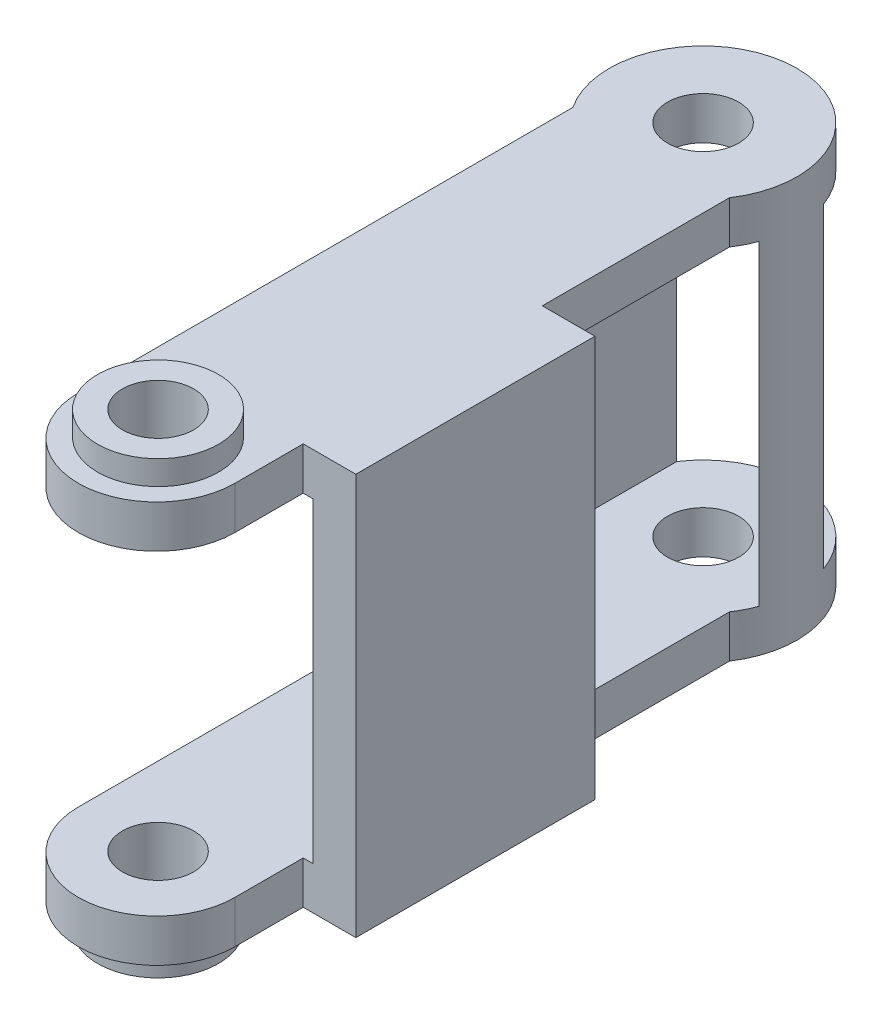
ISO-10303-21;
HEADER;
FILE_DESCRIPTION(('STEP AP214'),'2;1');
FILE_NAME('part.step','',(''),(''),'','','');
FILE_SCHEMA(('AUTOMOTIVE_DESIGN { 1 0 10303 214 1 1 1 1 }'));
ENDSEC;
DATA;
#1=APPLICATION_CONTEXT('core data for automotive mechanical design processes');
#2=APPLICATION_PROTOCOL_DEFINITION('international standard','automotive_design',2000,#1);
#3=PRODUCT_CONTEXT('',#1,'mechanical');
#4=PRODUCT('Part','Part','',(#3));
#5=PRODUCT_RELATED_PRODUCT_CATEGORY('part','',(#4));
#6=PRODUCT_DEFINITION_FORMATION('','',#4);
#7=PRODUCT_DEFINITION_CONTEXT('part definition',#1,'design');
#8=PRODUCT_DEFINITION('design','',#6,#7);
#9=PRODUCT_DEFINITION_SHAPE('','',#8);
#10=(LENGTH_UNIT() NAMED_UNIT(*) SI_UNIT(.MILLI.,.METRE.));
#11=(NAMED_UNIT(*) PLANE_ANGLE_UNIT() SI_UNIT($,.RADIAN.));
#12=(NAMED_UNIT(*) SI_UNIT($,.STERADIAN.) SOLID_ANGLE_UNIT());
#13=UNCERTAINTY_MEASURE_WITH_UNIT(LENGTH_MEASURE(1.E-05),#10,'distance_accuracy_value','');
#14=(GEOMETRIC_REPRESENTATION_CONTEXT(3) GLOBAL_UNCERTAINTY_ASSIGNED_CONTEXT((#13)) GLOBAL_UNIT_ASSIGNED_CONTEXT((#10,
#11,#12)) REPRESENTATION_CONTEXT('',''));
#15=CARTESIAN_POINT('',(0.,0.,0.));
#16=DIRECTION('',(0.,0.,1.));
#17=DIRECTION('',(1.,0.,0.));
#18=AXIS2_PLACEMENT_3D('',#15,#16,#17);
#19=CARTESIAN_POINT('',(-1.29999999999786,15.8000000000004,19.6500000000019));
#20=DIRECTION('',(0.,1.,0.));
#21=DIRECTION('',(0.,0.,1.));
#22=AXIS2_PLACEMENT_3D('',#19,#20,#21);
#23=PLANE('',#22);
#24=CARTESIAN_POINT('',(-1.29999999999786,15.8000000000004,19.6500000000019));
#25=DIRECTION('',(0.,1.,0.));
#26=DIRECTION('',(0.,0.,1.));
#27=AXIS2_PLACEMENT_3D('',#24,#25,#26);
#28=CIRCLE('',#27,2.5);
#29=CARTESIAN_POINT('',(-1.29999999999786,15.8000000000004,22.1500000000019));
#30=VERTEX_POINT('',#29);
#31=EDGE_CURVE('E19',#30,#30,#28,.F.);
#32=ORIENTED_EDGE('',*,*,#31,.T.);
#33=EDGE_LOOP('',(#32));
#34=FACE_BOUND('',#33,.T.);
#35=CARTESIAN_POINT('',(-1.29999999999786,15.8000000000004,19.6500000000019));
#36=DIRECTION('',(0.,1.,0.));
#37=DIRECTION('',(0.,0.,1.));
#38=AXIS2_PLACEMENT_3D('',#35,#36,#37);
#39=CIRCLE('',#38,4.25);
#40=CARTESIAN_POINT('',(-1.29999999999786,15.8000000000004,23.9000000000019));
#41=VERTEX_POINT('',#40);
#42=EDGE_CURVE('E115',#41,#41,#39,.F.);
#43=ORIENTED_EDGE('',*,*,#42,.F.);
#44=EDGE_LOOP('',(#43));
#45=FACE_BOUND('',#44,.T.);
#46=ADVANCED_FACE('F16',(#34,#45),#23,.T.);
#47=CARTESIAN_POINT('',(-1.29999999999791,-15.7999999999996,19.6500000000019));
#48=DIRECTION('',(0.,1.,0.));
#49=DIRECTION('',(0.,0.,1.));
#50=AXIS2_PLACEMENT_3D('',#47,#48,#49);
#51=CYLINDRICAL_SURFACE('',#50,2.5);
#52=CARTESIAN_POINT('',(-1.29999999999786,11.1000000000001,19.6500000000019));
#53=DIRECTION('',(0.,1.,0.));
#54=DIRECTION('',(0.,0.,1.));
#55=AXIS2_PLACEMENT_3D('',#52,#53,#54);
#56=CIRCLE('',#55,2.5);
#57=CARTESIAN_POINT('',(-1.29999999999786,11.1000000000001,22.1500000000019));
#58=VERTEX_POINT('',#57);
#59=EDGE_CURVE('E202',#58,#58,#56,.F.);
#60=ORIENTED_EDGE('',*,*,#59,.T.);
#61=EDGE_LOOP('',(#60));
#62=FACE_BOUND('',#61,.T.);
#63=ORIENTED_EDGE('',*,*,#31,.F.);
#64=EDGE_LOOP('',(#63));
#65=FACE_BOUND('',#64,.T.);
#66=ADVANCED_FACE('F214',(#62,#65),#51,.F.);
#67=CARTESIAN_POINT('',(-1.29999999999791,-14.0999999999996,19.7500000000022));
#68=DIRECTION('',(0.,1.,0.));
#69=DIRECTION('',(0.,0.,1.));
#70=AXIS2_PLACEMENT_3D('',#67,#68,#69);
#71=CYLINDRICAL_SURFACE('',#70,5.5);
#72=CARTESIAN_POINT('',(-1.29999999999775,14.1000000000004,19.7500000000022));
#73=DIRECTION('',(0.,1.,0.));
#74=DIRECTION('',(0.,0.,1.));
#75=AXIS2_PLACEMENT_3D('',#72,#73,#74);
#76=CIRCLE('',#75,5.5);
#77=CARTESIAN_POINT('',(-6.7999999999977,14.1000000000004,19.750000000002));
#78=VERTEX_POINT('',#77);
#79=CARTESIAN_POINT('',(4.20000000000242,14.1000000000004,19.750000000002));
#80=VERTEX_POINT('',#79);
#81=EDGE_CURVE('E196',#78,#80,#76,.T.);
#82=ORIENTED_EDGE('',*,*,#81,.F.);
#83=DIRECTION('',(0.,1.,0.));
#84=VECTOR('',#83,1.);
#85=CARTESIAN_POINT('',(-6.79999999999781,-14.0999999999996,19.7500000000022));
#86=LINE('',#85,#84);
#87=CARTESIAN_POINT('',(-6.7999999999977,11.1000000000001,19.750000000002));
#88=VERTEX_POINT('',#87);
#89=EDGE_CURVE('E113',#88,#78,#86,.T.);
#90=ORIENTED_EDGE('',*,*,#89,.F.);
#91=CARTESIAN_POINT('',(-1.29999999999775,11.1000000000001,19.7500000000022));
#92=DIRECTION('',(0.,1.,0.));
#93=DIRECTION('',(0.,0.,1.));
#94=AXIS2_PLACEMENT_3D('',#91,#92,#93);
#95=CIRCLE('',#94,5.5);
#96=CARTESIAN_POINT('',(4.20000000000237,11.1000000000001,19.7500000000024));
#97=VERTEX_POINT('',#96);
#98=EDGE_CURVE('E103',#88,#97,#95,.T.);
#99=ORIENTED_EDGE('',*,*,#98,.T.);
#100=DIRECTION('',(0.,1.,0.));
#101=VECTOR('',#100,1.);
#102=CARTESIAN_POINT('',(4.20000000000209,-14.0999999999996,19.7500000000022));
#103=LINE('',#102,#101);
#104=EDGE_CURVE('E111',#80,#97,#103,.F.);
#105=ORIENTED_EDGE('',*,*,#104,.F.);
#106=EDGE_LOOP('',(#82,#90,#99,#105));
#107=FACE_BOUND('',#106,.T.);
#108=ADVANCED_FACE('F110',(#107),#71,.T.);
#109=CARTESIAN_POINT('',(-1.29999999999786,14.1000000000004,19.6500000000019));
#110=DIRECTION('',(0.,1.,0.));
#111=DIRECTION('',(0.,0.,1.));
#112=AXIS2_PLACEMENT_3D('',#109,#110,#111);
#113=CYLINDRICAL_SURFACE('',#112,4.25);
#114=CARTESIAN_POINT('',(-1.29999999999786,14.1000000000004,19.6500000000019));
#115=DIRECTION('',(0.,1.,0.));
#116=DIRECTION('',(0.,0.,1.));
#117=AXIS2_PLACEMENT_3D('',#114,#115,#116);
#118=CIRCLE('',#117,4.25);
#119=CARTESIAN_POINT('',(-1.29999999999786,14.1000000000004,23.9000000000019));
#120=VERTEX_POINT('',#119);
#121=EDGE_CURVE('E193',#120,#120,#118,.F.);
#122=ORIENTED_EDGE('',*,*,#121,.F.);
#123=EDGE_LOOP('',(#122));
#124=FACE_BOUND('',#123,.T.);
#125=ORIENTED_EDGE('',*,*,#42,.T.);
#126=EDGE_LOOP('',(#125));
#127=FACE_BOUND('',#126,.T.);
#128=ADVANCED_FACE('F222',(#124,#127),#113,.T.);
#129=CARTESIAN_POINT('',(-1.29999999999769,-14.0999999999999,-18.6499999999979));
#130=DIRECTION('',(0.,1.,0.));
#131=DIRECTION('',(0.,0.,1.));
#132=AXIS2_PLACEMENT_3D('',#129,#130,#131);
#133=CYLINDRICAL_SURFACE('',#132,2.5);
#134=CARTESIAN_POINT('',(-1.29999999999769,11.0999999999998,-18.6499999999979));
#135=DIRECTION('',(0.,1.,0.));
#136=DIRECTION('',(0.,0.,1.));
#137=AXIS2_PLACEMENT_3D('',#134,#135,#136);
#138=CIRCLE('',#137,2.5);
#139=CARTESIAN_POINT('',(-1.29999999999769,11.0999999999998,-16.1499999999979));
#140=VERTEX_POINT('',#139);
#141=EDGE_CURVE('E198',#140,#140,#138,.F.);
#142=ORIENTED_EDGE('',*,*,#141,.T.);
#143=EDGE_LOOP('',(#142));
#144=FACE_BOUND('',#143,.T.);
#145=CARTESIAN_POINT('',(-1.29999999999769,14.1000000000001,-18.6499999999979));
#146=DIRECTION('',(0.,1.,0.));
#147=DIRECTION('',(0.,0.,1.));
#148=AXIS2_PLACEMENT_3D('',#145,#146,#147);
#149=CIRCLE('',#148,2.5);
#150=CARTESIAN_POINT('',(-1.29999999999769,14.1000000000001,-16.1499999999979));
#151=VERTEX_POINT('',#150);
#152=EDGE_CURVE('E189',#151,#151,#149,.F.);
#153=ORIENTED_EDGE('',*,*,#152,.F.);
#154=EDGE_LOOP('',(#153));
#155=FACE_BOUND('',#154,.T.);
#156=ADVANCED_FACE('F313',(#144,#155),#133,.F.);
#157=CARTESIAN_POINT('',(-1.29999999999791,-15.7999999999996,19.6500000000019));
#158=DIRECTION('',(0.,1.,0.));
#159=DIRECTION('',(0.,0.,1.));
#160=AXIS2_PLACEMENT_3D('',#157,#158,#159);
#161=CYLINDRICAL_SURFACE('',#160,2.5);
#162=CARTESIAN_POINT('',(-1.29999999999791,-11.0999999999998,19.6500000000019));
#163=DIRECTION('',(0.,1.,0.));
#164=DIRECTION('',(0.,0.,1.));
#165=AXIS2_PLACEMENT_3D('',#162,#163,#164);
#166=CIRCLE('',#165,2.5);
#167=CARTESIAN_POINT('',(-1.29999999999791,-11.0999999999998,22.1500000000019));
#168=VERTEX_POINT('',#167);
#169=EDGE_CURVE('E180',#168,#168,#166,.T.);
#170=ORIENTED_EDGE('',*,*,#169,.T.);
#171=EDGE_LOOP('',(#170));
#172=FACE_BOUND('',#171,.T.);
#173=CARTESIAN_POINT('',(-1.29999999999791,-15.7999999999996,19.6500000000019));
#174=DIRECTION('',(0.,1.,0.));
#175=DIRECTION('',(0.,0.,1.));
#176=AXIS2_PLACEMENT_3D('',#173,#174,#175);
#177=CIRCLE('',#176,2.5);
#178=CARTESIAN_POINT('',(-1.29999999999791,-15.7999999999996,22.1500000000019));
#179=VERTEX_POINT('',#178);
#180=EDGE_CURVE('E184',#179,#179,#177,.T.);
#181=ORIENTED_EDGE('',*,*,#180,.F.);
#182=EDGE_LOOP('',(#181));
#183=FACE_BOUND('',#182,.T.);
#184=ADVANCED_FACE('F309',(#172,#183),#161,.F.);
#185=CARTESIAN_POINT('',(-6.79999999999753,11.1000000000001,49.7500000000021));
#186=DIRECTION('',(0.,1.,0.));
#187=DIRECTION('',(0.,0.,1.));
#188=AXIS2_PLACEMENT_3D('',#185,#186,#187);
#189=PLANE('',#188);
#190=ORIENTED_EDGE('',*,*,#141,.F.);
#191=EDGE_LOOP('',(#190));
#192=FACE_BOUND('',#191,.T.);
#193=ORIENTED_EDGE('',*,*,#59,.F.);
#194=EDGE_LOOP('',(#193));
#195=FACE_BOUND('',#194,.T.);
#196=DIRECTION('',(0.,0.,-1.));
#197=VECTOR('',#196,1.);
#198=CARTESIAN_POINT('',(4.20000000000223,11.0999999999998,-15.0017127305992));
#199=LINE('',#198,#197);
#200=CARTESIAN_POINT('',(4.20000000000242,11.0999999999998,-1.84999999999802));
#201=VERTEX_POINT('',#200);
#202=CARTESIAN_POINT('',(4.20000000000206,11.0999999999998,-15.0017127305995));
#203=VERTEX_POINT('',#202);
#204=EDGE_CURVE('E192',#201,#203,#199,.T.);
#205=ORIENTED_EDGE('',*,*,#204,.F.);
#206=DIRECTION('',(1.,0.,0.));
#207=VECTOR('',#206,1.);
#208=CARTESIAN_POINT('',(-6.79999999999759,11.0999999999998,-1.84999999999802));
#209=LINE('',#208,#207);
#210=CARTESIAN_POINT('',(4.9000000000024,11.0999999999998,-1.84999999999802));
#211=VERTEX_POINT('',#210);
#212=EDGE_CURVE('E139',#211,#201,#209,.F.);
#213=ORIENTED_EDGE('',*,*,#212,.F.);
#214=DIRECTION('',(0.,0.,-1.));
#215=VECTOR('',#214,1.);
#216=CARTESIAN_POINT('',(4.90000000000212,11.0999999999998,2.37414363470123));
#217=LINE('',#216,#215);
#218=CARTESIAN_POINT('',(4.90000000000251,11.1000000000001,14.9500000000019));
#219=VERTEX_POINT('',#218);
#220=EDGE_CURVE('E125',#211,#219,#217,.F.);
#221=ORIENTED_EDGE('',*,*,#220,.T.);
#222=DIRECTION('',(1.,0.,0.));
#223=VECTOR('',#222,1.);
#224=CARTESIAN_POINT('',(-6.79999999999775,11.1000000000001,14.950000000002));
#225=LINE('',#224,#223);
#226=CARTESIAN_POINT('',(4.20000000000226,11.1000000000001,14.950000000002));
#227=VERTEX_POINT('',#226);
#228=EDGE_CURVE('E114',#227,#219,#225,.T.);
#229=ORIENTED_EDGE('',*,*,#228,.F.);
#230=DIRECTION('',(0.,0.,-1.));
#231=VECTOR('',#230,1.);
#232=CARTESIAN_POINT('',(4.20000000000226,11.1000000000001,14.950000000002));
#233=LINE('',#232,#231);
#234=EDGE_CURVE('E121',#97,#227,#233,.T.);
#235=ORIENTED_EDGE('',*,*,#234,.F.);
#236=ORIENTED_EDGE('',*,*,#98,.F.);
#237=DIRECTION('',(0.,0.,1.));
#238=VECTOR('',#237,1.);
#239=CARTESIAN_POINT('',(-6.7999999999977,11.1000000000001,19.750000000002));
#240=LINE('',#239,#238);
#241=CARTESIAN_POINT('',(-6.79999999999795,11.0999999999998,-15.0017127305996));
#242=VERTEX_POINT('',#241);
#243=EDGE_CURVE('E133',#242,#88,#240,.T.);
#244=ORIENTED_EDGE('',*,*,#243,.F.);
#245=DIRECTION('',(0.,0.,-1.));
#246=VECTOR('',#245,1.);
#247=CARTESIAN_POINT('',(-6.79999999999781,11.1000000000001,2.37414363470134));
#248=LINE('',#247,#246);
#249=CARTESIAN_POINT('',(-6.79999999999792,11.1000000000002,-22.2982872693964));
#250=VERTEX_POINT('',#249);
#251=EDGE_CURVE('E201',#250,#242,#248,.F.);
#252=ORIENTED_EDGE('',*,*,#251,.F.);
#253=CARTESIAN_POINT('',(-1.29999999999778,11.0999999999998,-18.6499999999979));
#254=DIRECTION('',(0.,1.,0.));
#255=DIRECTION('',(0.,0.,1.));
#256=AXIS2_PLACEMENT_3D('',#253,#254,#255);
#257=CIRCLE('',#256,6.60000000000415);
#258=CARTESIAN_POINT('',(4.90000000000212,11.0999999999998,-20.9127416998071));
#259=VERTEX_POINT('',#258);
#260=EDGE_CURVE('E178',#259,#250,#257,.T.);
#261=ORIENTED_EDGE('',*,*,#260,.F.);
#262=DIRECTION('',(0.,0.,-1.));
#263=VECTOR('',#262,1.);
#264=CARTESIAN_POINT('',(4.90000000000212,11.0999999999998,2.37414363470123));
#265=LINE('',#264,#263);
#266=CARTESIAN_POINT('',(4.90000000000215,11.0999999999998,-16.3872583001889));
#267=VERTEX_POINT('',#266);
#268=EDGE_CURVE('E188',#259,#267,#265,.F.);
#269=ORIENTED_EDGE('',*,*,#268,.T.);
#270=CARTESIAN_POINT('',(-1.29999999999778,11.0999999999998,-18.6499999999979));
#271=DIRECTION('',(0.,1.,0.));
#272=DIRECTION('',(0.,0.,1.));
#273=AXIS2_PLACEMENT_3D('',#270,#271,#272);
#274=CIRCLE('',#273,6.60000000000415);
#275=EDGE_CURVE('E205',#203,#267,#274,.T.);
#276=ORIENTED_EDGE('',*,*,#275,.F.);
#277=EDGE_LOOP('',(#205,#213,#221,#229,#235,#236,#244,#252,#261,#269,#276));
#278=FACE_BOUND('',#277,.T.);
#279=ADVANCED_FACE('F129',(#192,#195,#278),#189,.F.);
#280=CARTESIAN_POINT('',(-6.79999999999803,1.66533453693773E-13,2.37414363470123));
#281=DIRECTION('',(1.,0.,0.));
#282=DIRECTION('',(0.,0.,-1.));
#283=AXIS2_PLACEMENT_3D('',#280,#281,#282);
#284=PLANE('',#283);
#285=DIRECTION('',(0.,1.,0.));
#286=VECTOR('',#285,1.);
#287=CARTESIAN_POINT('',(-6.79999999999781,-14.0999999999996,-22.2982872693964));
#288=LINE('',#287,#286);
#289=CARTESIAN_POINT('',(-6.79999999999781,-11.0999999999998,-22.2982872693964));
#290=VERTEX_POINT('',#289);
#291=EDGE_CURVE('E177',#250,#290,#288,.F.);
#292=ORIENTED_EDGE('',*,*,#291,.F.);
#293=ORIENTED_EDGE('',*,*,#251,.T.);
#294=DIRECTION('',(0.,1.,0.));
#295=VECTOR('',#294,1.);
#296=CARTESIAN_POINT('',(-6.79999999999795,-14.0999999999999,-15.0017127305996));
#297=LINE('',#296,#295);
#298=CARTESIAN_POINT('',(-6.79999999999797,-11.1000000000001,-15.0017127305996));
#299=VERTEX_POINT('',#298);
#300=EDGE_CURVE('E464',#299,#242,#297,.T.);
#301=ORIENTED_EDGE('',*,*,#300,.F.);
#302=DIRECTION('',(0.,0.,-1.));
#303=VECTOR('',#302,1.);
#304=CARTESIAN_POINT('',(-6.79999999999792,-11.0999999999998,-45.0017127305995));
#305=LINE('',#304,#303);
#306=EDGE_CURVE('E394',#299,#290,#305,.T.);
#307=ORIENTED_EDGE('',*,*,#306,.T.);
#308=EDGE_LOOP('',(#292,#293,#301,#307));
#309=FACE_BOUND('',#308,.T.);
#310=ADVANCED_FACE('F302',(#309),#284,.T.);
#311=CARTESIAN_POINT('',(-6.79999999999781,-14.0999999999996,19.7500000000022));
#312=DIRECTION('',(-1.,0.,0.));
#313=DIRECTION('',(0.,0.,1.));
#314=AXIS2_PLACEMENT_3D('',#311,#312,#313);
#315=PLANE('',#314);
#316=DIRECTION('',(0.,0.,1.));
#317=VECTOR('',#316,1.);
#318=CARTESIAN_POINT('',(-6.79999999999764,14.1000000000001,0.186453024181965));
#319=LINE('',#318,#317);
#320=CARTESIAN_POINT('',(-6.79999999999795,14.1000000000001,-15.0017127305996));
#321=VERTEX_POINT('',#320);
#322=EDGE_CURVE('E143',#321,#78,#319,.T.);
#323=ORIENTED_EDGE('',*,*,#322,.F.);
#324=DIRECTION('',(0.,1.,0.));
#325=VECTOR('',#324,1.);
#326=CARTESIAN_POINT('',(-6.79999999999795,-14.0999999999999,-15.0017127305996));
#327=LINE('',#326,#325);
#328=EDGE_CURVE('E461',#242,#321,#327,.T.);
#329=ORIENTED_EDGE('',*,*,#328,.F.);
#330=ORIENTED_EDGE('',*,*,#243,.T.);
#331=ORIENTED_EDGE('',*,*,#89,.T.);
#332=EDGE_LOOP('',(#323,#329,#330,#331));
#333=FACE_BOUND('',#332,.T.);
#334=ADVANCED_FACE('F299',(#333),#315,.T.);
#335=CARTESIAN_POINT('',(4.2000000000022,-14.0999999999996,14.950000000002));
#336=DIRECTION('',(1.,0.,0.));
#337=DIRECTION('',(0.,0.,-1.));
#338=AXIS2_PLACEMENT_3D('',#335,#336,#337);
#339=PLANE('',#338);
#340=DIRECTION('',(0.,0.,1.));
#341=VECTOR('',#340,1.);
#342=CARTESIAN_POINT('',(4.20000000000237,14.1000000000001,0.186453024181854));
#343=LINE('',#342,#341);
#344=CARTESIAN_POINT('',(4.2000000000022,14.1000000000004,14.950000000002));
#345=VERTEX_POINT('',#344);
#346=EDGE_CURVE('E124',#80,#345,#343,.F.);
#347=ORIENTED_EDGE('',*,*,#346,.F.);
#348=ORIENTED_EDGE('',*,*,#104,.T.);
#349=ORIENTED_EDGE('',*,*,#234,.T.);
#350=DIRECTION('',(0.,1.,0.));
#351=VECTOR('',#350,1.);
#352=CARTESIAN_POINT('',(4.2000000000022,-14.0999999999996,14.950000000002));
#353=LINE('',#352,#351);
#354=EDGE_CURVE('E442',#345,#227,#353,.F.);
#355=ORIENTED_EDGE('',*,*,#354,.F.);
#356=EDGE_LOOP('',(#347,#348,#349,#355));
#357=FACE_BOUND('',#356,.T.);
#358=ADVANCED_FACE('F119',(#357),#339,.T.);
#359=CARTESIAN_POINT('',(4.90000000000201,-1.66533453693773E-13,2.37414363470123));
#360=DIRECTION('',(1.,0.,0.));
#361=DIRECTION('',(0.,0.,-1.));
#362=AXIS2_PLACEMENT_3D('',#359,#360,#361);
#363=PLANE('',#362);
#364=DIRECTION('',(0.,0.,-1.));
#365=VECTOR('',#364,1.);
#366=CARTESIAN_POINT('',(4.9000000000021,-11.0999999999998,-45.0017127305996));
#367=LINE('',#366,#365);
#368=CARTESIAN_POINT('',(4.90000000000212,-11.1000000000001,-1.84999999999802));
#369=VERTEX_POINT('',#368);
#370=CARTESIAN_POINT('',(4.90000000000224,-11.0999999999998,14.950000000002));
#371=VERTEX_POINT('',#370);
#372=EDGE_CURVE('E187',#369,#371,#367,.F.);
#373=ORIENTED_EDGE('',*,*,#372,.T.);
#374=DIRECTION('',(0.,1.,0.));
#375=VECTOR('',#374,1.);
#376=CARTESIAN_POINT('',(4.90000000000224,-14.0999999999996,14.950000000002));
#377=LINE('',#376,#375);
#378=EDGE_CURVE('E343',#219,#371,#377,.F.);
#379=ORIENTED_EDGE('',*,*,#378,.F.);
#380=ORIENTED_EDGE('',*,*,#220,.F.);
#381=DIRECTION('',(0.,1.,0.));
#382=VECTOR('',#381,1.);
#383=CARTESIAN_POINT('',(4.90000000000212,-14.0999999999999,-1.84999999999802));
#384=LINE('',#383,#382);
#385=EDGE_CURVE('E418',#369,#211,#384,.T.);
#386=ORIENTED_EDGE('',*,*,#385,.F.);
#387=EDGE_LOOP('',(#373,#379,#380,#386));
#388=FACE_BOUND('',#387,.T.);
#389=ADVANCED_FACE('F292',(#388),#363,.F.);
#390=CARTESIAN_POINT('',(-0.349717552540985,14.1000000000001,0.186453024181854));
#391=DIRECTION('',(0.,1.,0.));
#392=DIRECTION('',(0.,0.,1.));
#393=AXIS2_PLACEMENT_3D('',#390,#391,#392);
#394=PLANE('',#393);
#395=ORIENTED_EDGE('',*,*,#152,.T.);
#396=EDGE_LOOP('',(#395));
#397=FACE_BOUND('',#396,.T.);
#398=ORIENTED_EDGE('',*,*,#121,.T.);
#399=EDGE_LOOP('',(#398));
#400=FACE_BOUND('',#399,.T.);
#401=DIRECTION('',(0.,0.,-1.));
#402=VECTOR('',#401,1.);
#403=CARTESIAN_POINT('',(7.90000000000241,14.1000000000001,-1.8499999999978));
#404=LINE('',#403,#402);
#405=CARTESIAN_POINT('',(7.90000000000241,14.1000000000001,-1.8499999999978));
#406=VERTEX_POINT('',#405);
#407=CARTESIAN_POINT('',(7.90000000000252,14.1000000000004,14.9500000000021));
#408=VERTEX_POINT('',#407);
#409=EDGE_CURVE('E330',#406,#408,#404,.F.);
#410=ORIENTED_EDGE('',*,*,#409,.F.);
#411=DIRECTION('',(-1.,0.,0.));
#412=VECTOR('',#411,1.);
#413=CARTESIAN_POINT('',(4.20000000000242,14.1000000000001,-1.84999999999802));
#414=LINE('',#413,#412);
#415=CARTESIAN_POINT('',(4.20000000000242,14.1000000000001,-1.84999999999802));
#416=VERTEX_POINT('',#415);
#417=EDGE_CURVE('E335',#416,#406,#414,.F.);
#418=ORIENTED_EDGE('',*,*,#417,.F.);
#419=DIRECTION('',(0.,0.,-1.));
#420=VECTOR('',#419,1.);
#421=CARTESIAN_POINT('',(4.20000000000223,14.1000000000001,-15.0017127305992));
#422=LINE('',#421,#420);
#423=CARTESIAN_POINT('',(4.20000000000206,14.1000000000001,-15.0017127305995));
#424=VERTEX_POINT('',#423);
#425=EDGE_CURVE('E404',#424,#416,#422,.F.);
#426=ORIENTED_EDGE('',*,*,#425,.F.);
#427=CARTESIAN_POINT('',(-1.29999999999778,14.1000000000001,-18.6499999999979));
#428=DIRECTION('',(0.,1.,0.));
#429=DIRECTION('',(0.,0.,1.));
#430=AXIS2_PLACEMENT_3D('',#427,#428,#429);
#431=CIRCLE('',#430,6.60000000000415);
#432=EDGE_CURVE('E165',#321,#424,#431,.F.);
#433=ORIENTED_EDGE('',*,*,#432,.F.);
#434=ORIENTED_EDGE('',*,*,#322,.T.);
#435=ORIENTED_EDGE('',*,*,#81,.T.);
#436=ORIENTED_EDGE('',*,*,#346,.T.);
#437=DIRECTION('',(1.,0.,0.));
#438=VECTOR('',#437,1.);
#439=CARTESIAN_POINT('',(7.90000000000252,14.1000000000004,14.9500000000021));
#440=LINE('',#439,#438);
#441=EDGE_CURVE('E338',#408,#345,#440,.F.);
#442=ORIENTED_EDGE('',*,*,#441,.F.);
#443=EDGE_LOOP('',(#410,#418,#426,#433,#434,#435,#436,#442));
#444=FACE_BOUND('',#443,.T.);
#445=ADVANCED_FACE('F288',(#397,#400,#444),#394,.T.);
#446=CARTESIAN_POINT('',(4.2000000000022,-14.0999999999999,-15.0017127305992));
#447=DIRECTION('',(1.,0.,0.));
#448=DIRECTION('',(0.,0.,-1.));
#449=AXIS2_PLACEMENT_3D('',#446,#447,#448);
#450=PLANE('',#449);
#451=ORIENTED_EDGE('',*,*,#425,.T.);
#452=DIRECTION('',(0.,1.,0.));
#453=VECTOR('',#452,1.);
#454=CARTESIAN_POINT('',(4.20000000000215,-14.0999999999999,-1.84999999999802));
#455=LINE('',#454,#453);
#456=EDGE_CURVE('E356',#201,#416,#455,.T.);
#457=ORIENTED_EDGE('',*,*,#456,.F.);
#458=ORIENTED_EDGE('',*,*,#204,.T.);
#459=DIRECTION('',(0.,1.,0.));
#460=VECTOR('',#459,1.);
#461=CARTESIAN_POINT('',(4.20000000000198,-14.0999999999999,-15.0017127305994));
#462=LINE('',#461,#460);
#463=EDGE_CURVE('E167',#424,#203,#462,.F.);
#464=ORIENTED_EDGE('',*,*,#463,.F.);
#465=EDGE_LOOP('',(#451,#457,#458,#464));
#466=FACE_BOUND('',#465,.T.);
#467=ADVANCED_FACE('F284',(#466),#450,.T.);
#468=CARTESIAN_POINT('',(4.90000000000201,-1.66533453693773E-13,2.37414363470123));
#469=DIRECTION('',(1.,0.,0.));
#470=DIRECTION('',(0.,0.,-1.));
#471=AXIS2_PLACEMENT_3D('',#468,#469,#470);
#472=PLANE('',#471);
#473=ORIENTED_EDGE('',*,*,#268,.F.);
#474=DIRECTION('',(0.,1.,0.));
#475=VECTOR('',#474,1.);
#476=CARTESIAN_POINT('',(4.9000000000021,-14.0999999999999,-20.9127416998071));
#477=LINE('',#476,#475);
#478=CARTESIAN_POINT('',(4.9000000000021,-11.1000000000001,-20.9127416998071));
#479=VERTEX_POINT('',#478);
#480=EDGE_CURVE('E176',#479,#259,#477,.T.);
#481=ORIENTED_EDGE('',*,*,#480,.F.);
#482=DIRECTION('',(0.,0.,-1.));
#483=VECTOR('',#482,1.);
#484=CARTESIAN_POINT('',(4.9000000000021,-11.0999999999998,-45.0017127305996));
#485=LINE('',#484,#483);
#486=CARTESIAN_POINT('',(4.90000000000212,-11.1000000000001,-16.3872583001889));
#487=VERTEX_POINT('',#486);
#488=EDGE_CURVE('E183',#479,#487,#485,.F.);
#489=ORIENTED_EDGE('',*,*,#488,.T.);
#490=DIRECTION('',(0.,1.,0.));
#491=VECTOR('',#490,1.);
#492=CARTESIAN_POINT('',(4.90000000000212,-14.0999999999999,-16.3872583001889));
#493=LINE('',#492,#491);
#494=EDGE_CURVE('E164',#267,#487,#493,.F.);
#495=ORIENTED_EDGE('',*,*,#494,.F.);
#496=EDGE_LOOP('',(#473,#481,#489,#495));
#497=FACE_BOUND('',#496,.T.);
#498=ADVANCED_FACE('F280',(#497),#472,.F.);
#499=CARTESIAN_POINT('',(-1.29999999999791,-15.7999999999996,19.6500000000019));
#500=DIRECTION('',(0.,-1.,0.));
#501=DIRECTION('',(0.,0.,-1.));
#502=AXIS2_PLACEMENT_3D('',#499,#500,#501);
#503=PLANE('',#502);
#504=ORIENTED_EDGE('',*,*,#180,.T.);
#505=EDGE_LOOP('',(#504));
#506=FACE_BOUND('',#505,.T.);
#507=CARTESIAN_POINT('',(-1.29999999999791,-15.7999999999996,19.6500000000019));
#508=DIRECTION('',(0.,-1.,0.));
#509=DIRECTION('',(0.,0.,-1.));
#510=AXIS2_PLACEMENT_3D('',#507,#508,#509);
#511=CIRCLE('',#510,4.25);
#512=CARTESIAN_POINT('',(-1.29999999999791,-15.7999999999996,15.4000000000019));
#513=VERTEX_POINT('',#512);
#514=EDGE_CURVE('E158',#513,#513,#511,.F.);
#515=ORIENTED_EDGE('',*,*,#514,.F.);
#516=EDGE_LOOP('',(#515));
#517=FACE_BOUND('',#516,.T.);
#518=ADVANCED_FACE('F276',(#506,#517),#503,.T.);
#519=CARTESIAN_POINT('',(-6.79999999999792,-11.0999999999998,-45.0017127305995));
#520=DIRECTION('',(0.,-1.,0.));
#521=DIRECTION('',(0.,0.,-1.));
#522=AXIS2_PLACEMENT_3D('',#519,#520,#521);
#523=PLANE('',#522);
#524=CARTESIAN_POINT('',(-1.29999999999769,-11.1000000000001,-18.6499999999979));
#525=DIRECTION('',(0.,1.,0.));
#526=DIRECTION('',(0.,0.,1.));
#527=AXIS2_PLACEMENT_3D('',#524,#525,#526);
#528=CIRCLE('',#527,2.5);
#529=CARTESIAN_POINT('',(-1.29999999999769,-11.1000000000001,-16.1499999999979));
#530=VERTEX_POINT('',#529);
#531=EDGE_CURVE('E155',#530,#530,#528,.F.);
#532=ORIENTED_EDGE('',*,*,#531,.T.);
#533=EDGE_LOOP('',(#532));
#534=FACE_BOUND('',#533,.T.);
#535=ORIENTED_EDGE('',*,*,#169,.F.);
#536=EDGE_LOOP('',(#535));
#537=FACE_BOUND('',#536,.T.);
#538=ORIENTED_EDGE('',*,*,#488,.F.);
#539=CARTESIAN_POINT('',(-1.2999999999978,-11.1000000000001,-18.6499999999979));
#540=DIRECTION('',(0.,1.,0.));
#541=DIRECTION('',(0.,0.,1.));
#542=AXIS2_PLACEMENT_3D('',#539,#540,#541);
#543=CIRCLE('',#542,6.60000000000415);
#544=EDGE_CURVE('E173',#290,#479,#543,.F.);
#545=ORIENTED_EDGE('',*,*,#544,.F.);
#546=ORIENTED_EDGE('',*,*,#306,.F.);
#547=DIRECTION('',(0.,0.,1.));
#548=VECTOR('',#547,1.);
#549=CARTESIAN_POINT('',(-6.79999999999781,-11.0999999999998,19.7500000000022));
#550=LINE('',#549,#548);
#551=CARTESIAN_POINT('',(-6.79999999999781,-11.0999999999998,19.7500000000022));
#552=VERTEX_POINT('',#551);
#553=EDGE_CURVE('E389',#552,#299,#550,.F.);
#554=ORIENTED_EDGE('',*,*,#553,.F.);
#555=CARTESIAN_POINT('',(-1.29999999999786,-11.0999999999998,19.750000000002));
#556=DIRECTION('',(0.,1.,0.));
#557=DIRECTION('',(0.,0.,1.));
#558=AXIS2_PLACEMENT_3D('',#555,#556,#557);
#559=CIRCLE('',#558,5.5);
#560=CARTESIAN_POINT('',(4.20000000000209,-11.0999999999998,19.7500000000022));
#561=VERTEX_POINT('',#560);
#562=EDGE_CURVE('E169',#561,#552,#559,.F.);
#563=ORIENTED_EDGE('',*,*,#562,.F.);
#564=DIRECTION('',(0.,0.,-1.));
#565=VECTOR('',#564,1.);
#566=CARTESIAN_POINT('',(4.20000000000215,-11.0999999999998,14.950000000002));
#567=LINE('',#566,#565);
#568=CARTESIAN_POINT('',(4.20000000000215,-11.0999999999998,14.950000000002));
#569=VERTEX_POINT('',#568);
#570=EDGE_CURVE('E385',#569,#561,#567,.F.);
#571=ORIENTED_EDGE('',*,*,#570,.F.);
#572=DIRECTION('',(1.,0.,0.));
#573=VECTOR('',#572,1.);
#574=CARTESIAN_POINT('',(7.90000000000229,-11.0999999999998,14.950000000002));
#575=LINE('',#574,#573);
#576=EDGE_CURVE('E380',#371,#569,#575,.F.);
#577=ORIENTED_EDGE('',*,*,#576,.F.);
#578=ORIENTED_EDGE('',*,*,#372,.F.);
#579=DIRECTION('',(-1.,0.,0.));
#580=VECTOR('',#579,1.);
#581=CARTESIAN_POINT('',(4.20000000000215,-11.1000000000001,-1.84999999999802));
#582=LINE('',#581,#580);
#583=CARTESIAN_POINT('',(4.20000000000215,-11.1000000000001,-1.84999999999802));
#584=VERTEX_POINT('',#583);
#585=EDGE_CURVE('E370',#584,#369,#582,.F.);
#586=ORIENTED_EDGE('',*,*,#585,.F.);
#587=DIRECTION('',(0.,0.,-1.));
#588=VECTOR('',#587,1.);
#589=CARTESIAN_POINT('',(4.2000000000022,-11.1000000000001,-15.0017127305992));
#590=LINE('',#589,#588);
#591=CARTESIAN_POINT('',(4.2000000000022,-11.1000000000001,-15.0017127305995));
#592=VERTEX_POINT('',#591);
#593=EDGE_CURVE('E352',#592,#584,#590,.F.);
#594=ORIENTED_EDGE('',*,*,#593,.F.);
#595=CARTESIAN_POINT('',(-1.2999999999978,-11.1000000000001,-18.6499999999979));
#596=DIRECTION('',(0.,1.,0.));
#597=DIRECTION('',(0.,0.,1.));
#598=AXIS2_PLACEMENT_3D('',#595,#596,#597);
#599=CIRCLE('',#598,6.60000000000415);
#600=EDGE_CURVE('E162',#487,#592,#599,.F.);
#601=ORIENTED_EDGE('',*,*,#600,.F.);
#602=EDGE_LOOP('',(#538,#545,#546,#554,#563,#571,#577,#578,#586,#594,#601));
#603=FACE_BOUND('',#602,.T.);
#604=ADVANCED_FACE('F272',(#534,#537,#603),#523,.F.);
#605=CARTESIAN_POINT('',(-6.79999999999781,-14.0999999999996,19.7500000000022));
#606=DIRECTION('',(-1.,0.,0.));
#607=DIRECTION('',(0.,0.,1.));
#608=AXIS2_PLACEMENT_3D('',#605,#606,#607);
#609=PLANE('',#608);
#610=DIRECTION('',(0.,0.,1.));
#611=VECTOR('',#610,1.);
#612=CARTESIAN_POINT('',(-6.79999999999775,-14.0999999999999,0.186453024181965));
#613=LINE('',#612,#611);
#614=CARTESIAN_POINT('',(-6.79999999999795,-14.0999999999999,-15.0017127305996));
#615=VERTEX_POINT('',#614);
#616=CARTESIAN_POINT('',(-6.79999999999781,-14.0999999999996,19.7500000000022));
#617=VERTEX_POINT('',#616);
#618=EDGE_CURVE('E153',#615,#617,#613,.T.);
#619=ORIENTED_EDGE('',*,*,#618,.T.);
#620=DIRECTION('',(0.,1.,0.));
#621=VECTOR('',#620,1.);
#622=CARTESIAN_POINT('',(-6.79999999999781,-14.0999999999996,19.7500000000022));
#623=LINE('',#622,#621);
#624=EDGE_CURVE('E171',#552,#617,#623,.F.);
#625=ORIENTED_EDGE('',*,*,#624,.F.);
#626=ORIENTED_EDGE('',*,*,#553,.T.);
#627=DIRECTION('',(0.,1.,0.));
#628=VECTOR('',#627,1.);
#629=CARTESIAN_POINT('',(-6.79999999999795,-14.0999999999999,-15.0017127305996));
#630=LINE('',#629,#628);
#631=EDGE_CURVE('E172',#299,#615,#630,.F.);
#632=ORIENTED_EDGE('',*,*,#631,.T.);
#633=EDGE_LOOP('',(#619,#625,#626,#632));
#634=FACE_BOUND('',#633,.T.);
#635=ADVANCED_FACE('F268',(#634),#609,.T.);
#636=CARTESIAN_POINT('',(-1.29999999999791,-14.0999999999996,19.7500000000022));
#637=DIRECTION('',(0.,1.,0.));
#638=DIRECTION('',(0.,0.,1.));
#639=AXIS2_PLACEMENT_3D('',#636,#637,#638);
#640=CYLINDRICAL_SURFACE('',#639,5.5);
#641=CARTESIAN_POINT('',(-1.29999999999791,-14.0999999999996,19.7500000000022));
#642=DIRECTION('',(0.,1.,0.));
#643=DIRECTION('',(0.,0.,1.));
#644=AXIS2_PLACEMENT_3D('',#641,#642,#643);
#645=CIRCLE('',#644,5.5);
#646=CARTESIAN_POINT('',(4.20000000000209,-14.0999999999996,19.7500000000022));
#647=VERTEX_POINT('',#646);
#648=EDGE_CURVE('E149',#617,#647,#645,.T.);
#649=ORIENTED_EDGE('',*,*,#648,.T.);
#650=DIRECTION('',(0.,1.,0.));
#651=VECTOR('',#650,1.);
#652=CARTESIAN_POINT('',(4.20000000000209,-14.0999999999996,19.7500000000022));
#653=LINE('',#652,#651);
#654=EDGE_CURVE('E383',#561,#647,#653,.F.);
#655=ORIENTED_EDGE('',*,*,#654,.F.);
#656=ORIENTED_EDGE('',*,*,#562,.T.);
#657=ORIENTED_EDGE('',*,*,#624,.T.);
#658=EDGE_LOOP('',(#649,#655,#656,#657));
#659=FACE_BOUND('',#658,.T.);
#660=ADVANCED_FACE('F264',(#659),#640,.T.);
#661=CARTESIAN_POINT('',(4.2000000000022,-14.0999999999996,14.950000000002));
#662=DIRECTION('',(1.,0.,0.));
#663=DIRECTION('',(0.,0.,-1.));
#664=AXIS2_PLACEMENT_3D('',#661,#662,#663);
#665=PLANE('',#664);
#666=DIRECTION('',(0.,0.,1.));
#667=VECTOR('',#666,1.);
#668=CARTESIAN_POINT('',(4.20000000000209,-14.0999999999999,0.186453024181854));
#669=LINE('',#668,#667);
#670=CARTESIAN_POINT('',(4.2000000000022,-14.0999999999996,14.950000000002));
#671=VERTEX_POINT('',#670);
#672=EDGE_CURVE('E152',#647,#671,#669,.F.);
#673=ORIENTED_EDGE('',*,*,#672,.T.);
#674=DIRECTION('',(0.,1.,0.));
#675=VECTOR('',#674,1.);
#676=CARTESIAN_POINT('',(4.2000000000022,-14.0999999999996,14.950000000002));
#677=LINE('',#676,#675);
#678=EDGE_CURVE('E377',#569,#671,#677,.F.);
#679=ORIENTED_EDGE('',*,*,#678,.F.);
#680=ORIENTED_EDGE('',*,*,#570,.T.);
#681=ORIENTED_EDGE('',*,*,#654,.T.);
#682=EDGE_LOOP('',(#673,#679,#680,#681));
#683=FACE_BOUND('',#682,.T.);
#684=ADVANCED_FACE('F260',(#683),#665,.T.);
#685=CARTESIAN_POINT('',(7.90000000000229,-14.0999999999996,14.950000000002));
#686=DIRECTION('',(0.,0.,1.));
#687=DIRECTION('',(1.,0.,0.));
#688=AXIS2_PLACEMENT_3D('',#685,#686,#687);
#689=PLANE('',#688);
#690=ORIENTED_EDGE('',*,*,#228,.T.);
#691=ORIENTED_EDGE('',*,*,#378,.T.);
#692=ORIENTED_EDGE('',*,*,#576,.T.);
#693=ORIENTED_EDGE('',*,*,#678,.T.);
#694=DIRECTION('',(1.,0.,0.));
#695=VECTOR('',#694,1.);
#696=CARTESIAN_POINT('',(-0.349717552541151,-14.0999999999996,14.950000000002));
#697=LINE('',#696,#695);
#698=CARTESIAN_POINT('',(7.90000000000229,-14.0999999999996,14.950000000002));
#699=VERTEX_POINT('',#698);
#700=EDGE_CURVE('E366',#671,#699,#697,.T.);
#701=ORIENTED_EDGE('',*,*,#700,.T.);
#702=DIRECTION('',(0.,1.,0.));
#703=VECTOR('',#702,1.);
#704=CARTESIAN_POINT('',(7.90000000000229,-14.0999999999996,14.950000000002));
#705=LINE('',#704,#703);
#706=EDGE_CURVE('E342',#408,#699,#705,.F.);
#707=ORIENTED_EDGE('',*,*,#706,.F.);
#708=ORIENTED_EDGE('',*,*,#441,.T.);
#709=ORIENTED_EDGE('',*,*,#354,.T.);
#710=EDGE_LOOP('',(#690,#691,#692,#693,#701,#707,#708,#709));
#711=FACE_BOUND('',#710,.T.);
#712=ADVANCED_FACE('F256',(#711),#689,.T.);
#713=CARTESIAN_POINT('',(7.90000000000218,-14.0999999999999,-1.84999999999802));
#714=DIRECTION('',(1.,0.,0.));
#715=DIRECTION('',(0.,0.,-1.));
#716=AXIS2_PLACEMENT_3D('',#713,#714,#715);
#717=PLANE('',#716);
#718=DIRECTION('',(0.,0.,1.));
#719=VECTOR('',#718,1.);
#720=CARTESIAN_POINT('',(7.90000000000229,-14.0999999999999,0.186453024181854));
#721=LINE('',#720,#719);
#722=CARTESIAN_POINT('',(7.90000000000218,-14.0999999999999,-1.84999999999802));
#723=VERTEX_POINT('',#722);
#724=EDGE_CURVE('E349',#699,#723,#721,.F.);
#725=ORIENTED_EDGE('',*,*,#724,.T.);
#726=DIRECTION('',(0.,1.,0.));
#727=VECTOR('',#726,1.);
#728=CARTESIAN_POINT('',(7.90000000000218,-14.0999999999999,-1.84999999999802));
#729=LINE('',#728,#727);
#730=EDGE_CURVE('E347',#406,#723,#729,.F.);
#731=ORIENTED_EDGE('',*,*,#730,.F.);
#732=ORIENTED_EDGE('',*,*,#409,.T.);
#733=ORIENTED_EDGE('',*,*,#706,.T.);
#734=EDGE_LOOP('',(#725,#731,#732,#733));
#735=FACE_BOUND('',#734,.T.);
#736=ADVANCED_FACE('F252',(#735),#717,.T.);
#737=CARTESIAN_POINT('',(4.20000000000215,-14.0999999999999,-1.84999999999802));
#738=DIRECTION('',(0.,0.,-1.));
#739=DIRECTION('',(-1.,0.,0.));
#740=AXIS2_PLACEMENT_3D('',#737,#738,#739);
#741=PLANE('',#740);
#742=DIRECTION('',(1.,0.,0.));
#743=VECTOR('',#742,1.);
#744=CARTESIAN_POINT('',(-0.349717552541096,-14.0999999999999,-1.84999999999791));
#745=LINE('',#744,#743);
#746=CARTESIAN_POINT('',(4.20000000000215,-14.0999999999999,-1.84999999999802));
#747=VERTEX_POINT('',#746);
#748=EDGE_CURVE('E365',#723,#747,#745,.F.);
#749=ORIENTED_EDGE('',*,*,#748,.T.);
#750=DIRECTION('',(0.,1.,0.));
#751=VECTOR('',#750,1.);
#752=CARTESIAN_POINT('',(4.20000000000215,-14.0999999999999,-1.84999999999802));
#753=LINE('',#752,#751);
#754=EDGE_CURVE('E168',#584,#747,#753,.F.);
#755=ORIENTED_EDGE('',*,*,#754,.F.);
#756=ORIENTED_EDGE('',*,*,#585,.T.);
#757=ORIENTED_EDGE('',*,*,#385,.T.);
#758=ORIENTED_EDGE('',*,*,#212,.T.);
#759=ORIENTED_EDGE('',*,*,#456,.T.);
#760=ORIENTED_EDGE('',*,*,#417,.T.);
#761=ORIENTED_EDGE('',*,*,#730,.T.);
#762=EDGE_LOOP('',(#749,#755,#756,#757,#758,#759,#760,#761));
#763=FACE_BOUND('',#762,.T.);
#764=ADVANCED_FACE('F248',(#763),#741,.T.);
#765=CARTESIAN_POINT('',(4.2000000000022,-14.0999999999999,-15.0017127305992));
#766=DIRECTION('',(1.,0.,0.));
#767=DIRECTION('',(0.,0.,-1.));
#768=AXIS2_PLACEMENT_3D('',#765,#766,#767);
#769=PLANE('',#768);
#770=DIRECTION('',(0.,0.,1.));
#771=VECTOR('',#770,1.);
#772=CARTESIAN_POINT('',(4.20000000000209,-14.0999999999999,0.186453024181854));
#773=LINE('',#772,#771);
#774=CARTESIAN_POINT('',(4.2000000000022,-14.0999999999999,-15.0017127305995));
#775=VERTEX_POINT('',#774);
#776=EDGE_CURVE('E148',#747,#775,#773,.F.);
#777=ORIENTED_EDGE('',*,*,#776,.T.);
#778=DIRECTION('',(0.,1.,0.));
#779=VECTOR('',#778,1.);
#780=CARTESIAN_POINT('',(4.20000000000198,-14.0999999999999,-15.0017127305994));
#781=LINE('',#780,#779);
#782=EDGE_CURVE('E161',#592,#775,#781,.F.);
#783=ORIENTED_EDGE('',*,*,#782,.F.);
#784=ORIENTED_EDGE('',*,*,#593,.T.);
#785=ORIENTED_EDGE('',*,*,#754,.T.);
#786=EDGE_LOOP('',(#777,#783,#784,#785));
#787=FACE_BOUND('',#786,.T.);
#788=ADVANCED_FACE('F244',(#787),#769,.T.);
#789=CARTESIAN_POINT('',(-1.2999999999978,-14.0999999999999,-18.6499999999979));
#790=DIRECTION('',(0.,1.,0.));
#791=DIRECTION('',(0.,0.,1.));
#792=AXIS2_PLACEMENT_3D('',#789,#790,#791);
#793=CYLINDRICAL_SURFACE('',#792,6.60000000000415);
#794=ORIENTED_EDGE('',*,*,#782,.T.);
#795=CARTESIAN_POINT('',(-1.2999999999978,-14.0999999999999,-18.6499999999979));
#796=DIRECTION('',(0.,1.,0.));
#797=DIRECTION('',(0.,0.,1.));
#798=AXIS2_PLACEMENT_3D('',#795,#796,#797);
#799=CIRCLE('',#798,6.60000000000415);
#800=EDGE_CURVE('E34',#775,#615,#799,.T.);
#801=ORIENTED_EDGE('',*,*,#800,.T.);
#802=ORIENTED_EDGE('',*,*,#631,.F.);
#803=ORIENTED_EDGE('',*,*,#300,.T.);
#804=ORIENTED_EDGE('',*,*,#328,.T.);
#805=ORIENTED_EDGE('',*,*,#432,.T.);
#806=ORIENTED_EDGE('',*,*,#463,.T.);
#807=ORIENTED_EDGE('',*,*,#275,.T.);
#808=ORIENTED_EDGE('',*,*,#494,.T.);
#809=ORIENTED_EDGE('',*,*,#600,.T.);
#810=EDGE_LOOP('',(#794,#801,#802,#803,#804,#805,#806,#807,#808,#809));
#811=FACE_BOUND('',#810,.T.);
#812=ORIENTED_EDGE('',*,*,#544,.T.);
#813=ORIENTED_EDGE('',*,*,#480,.T.);
#814=ORIENTED_EDGE('',*,*,#260,.T.);
#815=ORIENTED_EDGE('',*,*,#291,.T.);
#816=EDGE_LOOP('',(#812,#813,#814,#815));
#817=FACE_BOUND('',#816,.T.);
#818=ADVANCED_FACE('F240',(#811,#817),#793,.T.);
#819=CARTESIAN_POINT('',(-1.29999999999791,-14.0999999999996,19.6500000000019));
#820=DIRECTION('',(0.,-1.,0.));
#821=DIRECTION('',(0.,0.,-1.));
#822=AXIS2_PLACEMENT_3D('',#819,#820,#821);
#823=CYLINDRICAL_SURFACE('',#822,4.25);
#824=ORIENTED_EDGE('',*,*,#514,.T.);
#825=EDGE_LOOP('',(#824));
#826=FACE_BOUND('',#825,.T.);
#827=CARTESIAN_POINT('',(-1.29999999999791,-14.0999999999996,19.6500000000019));
#828=DIRECTION('',(0.,-1.,0.));
#829=DIRECTION('',(0.,0.,-1.));
#830=AXIS2_PLACEMENT_3D('',#827,#828,#829);
#831=CIRCLE('',#830,4.25);
#832=CARTESIAN_POINT('',(-1.29999999999791,-14.0999999999996,15.4000000000019));
#833=VERTEX_POINT('',#832);
#834=EDGE_CURVE('E25',#833,#833,#831,.T.);
#835=ORIENTED_EDGE('',*,*,#834,.T.);
#836=EDGE_LOOP('',(#835));
#837=FACE_BOUND('',#836,.T.);
#838=ADVANCED_FACE('F232',(#826,#837),#823,.T.);
#839=CARTESIAN_POINT('',(-1.29999999999769,-14.0999999999999,-18.6499999999979));
#840=DIRECTION('',(0.,1.,0.));
#841=DIRECTION('',(0.,0.,1.));
#842=AXIS2_PLACEMENT_3D('',#839,#840,#841);
#843=CYLINDRICAL_SURFACE('',#842,2.5);
#844=ORIENTED_EDGE('',*,*,#531,.F.);
#845=EDGE_LOOP('',(#844));
#846=FACE_BOUND('',#845,.T.);
#847=CARTESIAN_POINT('',(-1.29999999999769,-14.0999999999999,-18.6499999999979));
#848=DIRECTION('',(0.,1.,0.));
#849=DIRECTION('',(0.,0.,1.));
#850=AXIS2_PLACEMENT_3D('',#847,#848,#849);
#851=CIRCLE('',#850,2.5);
#852=CARTESIAN_POINT('',(-1.29999999999769,-14.0999999999999,-16.1499999999979));
#853=VERTEX_POINT('',#852);
#854=EDGE_CURVE('E11',#853,#853,#851,.F.);
#855=ORIENTED_EDGE('',*,*,#854,.T.);
#856=EDGE_LOOP('',(#855));
#857=FACE_BOUND('',#856,.T.);
#858=ADVANCED_FACE('F226',(#846,#857),#843,.F.);
#859=CARTESIAN_POINT('',(-0.34971755254104,-14.0999999999999,0.186453024181854));
#860=DIRECTION('',(0.,1.,0.));
#861=DIRECTION('',(0.,0.,1.));
#862=AXIS2_PLACEMENT_3D('',#859,#860,#861);
#863=PLANE('',#862);
#864=ORIENTED_EDGE('',*,*,#854,.F.);
#865=EDGE_LOOP('',(#864));
#866=FACE_BOUND('',#865,.T.);
#867=ORIENTED_EDGE('',*,*,#834,.F.);
#868=EDGE_LOOP('',(#867));
#869=FACE_BOUND('',#868,.T.);
#870=ORIENTED_EDGE('',*,*,#776,.F.);
#871=ORIENTED_EDGE('',*,*,#748,.F.);
#872=ORIENTED_EDGE('',*,*,#724,.F.);
#873=ORIENTED_EDGE('',*,*,#700,.F.);
#874=ORIENTED_EDGE('',*,*,#672,.F.);
#875=ORIENTED_EDGE('',*,*,#648,.F.);
#876=ORIENTED_EDGE('',*,*,#618,.F.);
#877=ORIENTED_EDGE('',*,*,#800,.F.);
#878=EDGE_LOOP('',(#870,#871,#872,#873,#874,#875,#876,#877));
#879=FACE_BOUND('',#878,.T.);
#880=ADVANCED_FACE('F224',(#866,#869,#879),#863,.F.);
#881=CLOSED_SHELL('',(#46,#66,#108,#128,#156,#184,#279,#310,#334,#358,#389,#445,#467,#498,#518,
#604,#635,#660,#684,#712,#736,#764,#788,#818,#838,#858,#880));
#882=MANIFOLD_SOLID_BREP('B1',#881);
#883=ADVANCED_BREP_SHAPE_REPRESENTATION('',(#18,#882),#14);
#884=SHAPE_DEFINITION_REPRESENTATION(#9,#883);
ENDSEC;
END-ISO-10303-21;
